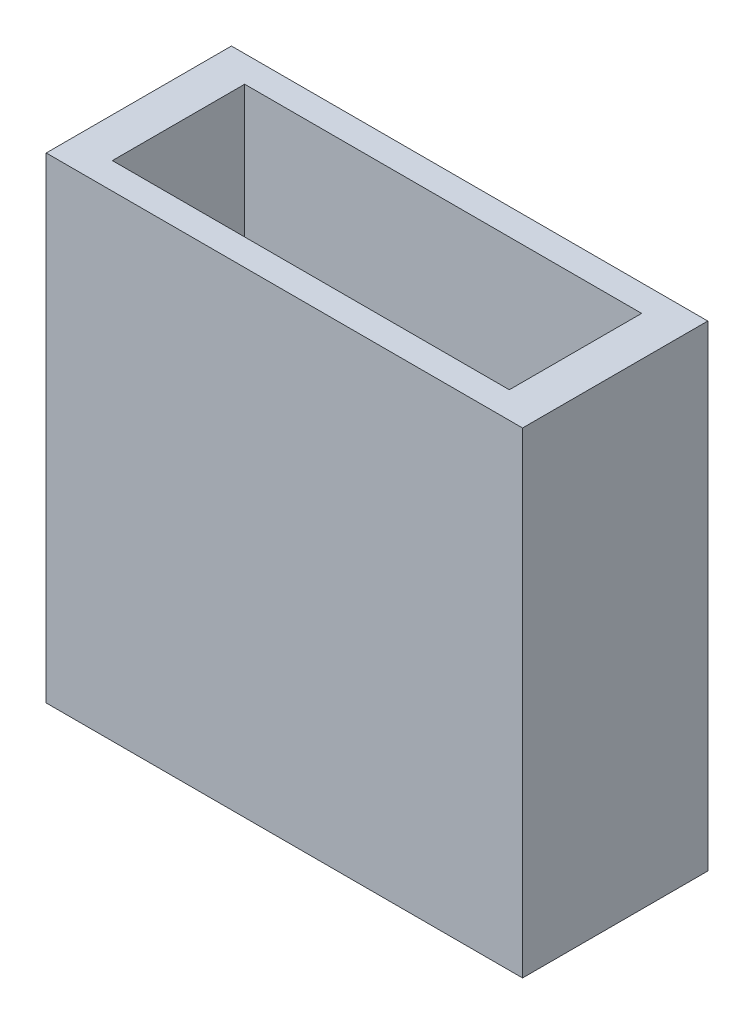
ISO-10303-21;
HEADER;
FILE_DESCRIPTION(('STEP AP214'),'2;1');
FILE_NAME('part.step','',(''),(''),'','','');
FILE_SCHEMA(('AUTOMOTIVE_DESIGN { 1 0 10303 214 1 1 1 1 }'));
ENDSEC;
DATA;
#1=APPLICATION_CONTEXT('core data for automotive mechanical design processes');
#2=APPLICATION_PROTOCOL_DEFINITION('international standard','automotive_design',2000,#1);
#3=PRODUCT_CONTEXT('',#1,'mechanical');
#4=PRODUCT('Part','Part','',(#3));
#5=PRODUCT_RELATED_PRODUCT_CATEGORY('part','',(#4));
#6=PRODUCT_DEFINITION_FORMATION('','',#4);
#7=PRODUCT_DEFINITION_CONTEXT('part definition',#1,'design');
#8=PRODUCT_DEFINITION('design','',#6,#7);
#9=PRODUCT_DEFINITION_SHAPE('','',#8);
#10=(LENGTH_UNIT() NAMED_UNIT(*) SI_UNIT(.MILLI.,.METRE.));
#11=(NAMED_UNIT(*) PLANE_ANGLE_UNIT() SI_UNIT($,.RADIAN.));
#12=(NAMED_UNIT(*) SI_UNIT($,.STERADIAN.) SOLID_ANGLE_UNIT());
#13=UNCERTAINTY_MEASURE_WITH_UNIT(LENGTH_MEASURE(1.E-05),#10,'distance_accuracy_value','');
#14=(GEOMETRIC_REPRESENTATION_CONTEXT(3) GLOBAL_UNCERTAINTY_ASSIGNED_CONTEXT((#13)) GLOBAL_UNIT_ASSIGNED_CONTEXT((#10,
#11,#12)) REPRESENTATION_CONTEXT('',''));
#15=CARTESIAN_POINT('',(0.,0.,0.));
#16=DIRECTION('',(0.,0.,1.));
#17=DIRECTION('',(1.,0.,0.));
#18=AXIS2_PLACEMENT_3D('',#15,#16,#17);
#19=CARTESIAN_POINT('',(0.,45.72,0.));
#20=DIRECTION('',(1.,0.,0.));
#21=DIRECTION('',(0.,0.,-1.));
#22=AXIS2_PLACEMENT_3D('',#19,#20,#21);
#23=PLANE('',#22);
#24=DIRECTION('',(0.,0.,1.));
#25=VECTOR('',#24,1.);
#26=CARTESIAN_POINT('',(0.,0.,0.));
#27=LINE('',#26,#25);
#28=CARTESIAN_POINT('',(0.,0.,-17.78));
#29=VERTEX_POINT('',#28);
#30=CARTESIAN_POINT('',(0.,0.,0.));
#31=VERTEX_POINT('',#30);
#32=EDGE_CURVE('E166',#29,#31,#27,.T.);
#33=ORIENTED_EDGE('',*,*,#32,.T.);
#34=DIRECTION('',(0.,-1.,0.));
#35=VECTOR('',#34,1.);
#36=CARTESIAN_POINT('',(0.,45.72,0.));
#37=LINE('',#36,#35);
#38=CARTESIAN_POINT('',(0.,45.72,0.));
#39=VERTEX_POINT('',#38);
#40=EDGE_CURVE('E11',#39,#31,#37,.T.);
#41=ORIENTED_EDGE('',*,*,#40,.F.);
#42=DIRECTION('',(0.,0.,1.));
#43=VECTOR('',#42,1.);
#44=CARTESIAN_POINT('',(0.,45.72,0.));
#45=LINE('',#44,#43);
#46=CARTESIAN_POINT('',(0.,45.72,-17.78));
#47=VERTEX_POINT('',#46);
#48=EDGE_CURVE('E172',#47,#39,#45,.T.);
#49=ORIENTED_EDGE('',*,*,#48,.F.);
#50=DIRECTION('',(0.,-1.,0.));
#51=VECTOR('',#50,1.);
#52=CARTESIAN_POINT('',(0.,45.72,-17.78));
#53=LINE('',#52,#51);
#54=EDGE_CURVE('E182',#47,#29,#53,.T.);
#55=ORIENTED_EDGE('',*,*,#54,.T.);
#56=EDGE_LOOP('',(#33,#41,#49,#55));
#57=FACE_BOUND('',#56,.T.);
#58=ADVANCED_FACE('F42',(#57),#23,.F.);
#59=CARTESIAN_POINT('',(0.,45.72,0.));
#60=DIRECTION('',(0.,0.,-1.));
#61=DIRECTION('',(-1.,0.,0.));
#62=AXIS2_PLACEMENT_3D('',#59,#60,#61);
#63=PLANE('',#62);
#64=DIRECTION('',(1.,0.,0.));
#65=VECTOR('',#64,1.);
#66=CARTESIAN_POINT('',(0.,0.,0.));
#67=LINE('',#66,#65);
#68=CARTESIAN_POINT('',(45.72,0.,0.));
#69=VERTEX_POINT('',#68);
#70=EDGE_CURVE('E186',#31,#69,#67,.T.);
#71=ORIENTED_EDGE('',*,*,#70,.T.);
#72=DIRECTION('',(0.,-1.,0.));
#73=VECTOR('',#72,1.);
#74=CARTESIAN_POINT('',(45.72,45.72,0.));
#75=LINE('',#74,#73);
#76=CARTESIAN_POINT('',(45.72,45.72,0.));
#77=VERTEX_POINT('',#76);
#78=EDGE_CURVE('E51',#77,#69,#75,.T.);
#79=ORIENTED_EDGE('',*,*,#78,.F.);
#80=DIRECTION('',(1.,0.,0.));
#81=VECTOR('',#80,1.);
#82=CARTESIAN_POINT('',(0.,45.72,0.));
#83=LINE('',#82,#81);
#84=EDGE_CURVE('E96',#39,#77,#83,.T.);
#85=ORIENTED_EDGE('',*,*,#84,.F.);
#86=ORIENTED_EDGE('',*,*,#40,.T.);
#87=EDGE_LOOP('',(#71,#79,#85,#86));
#88=FACE_BOUND('',#87,.T.);
#89=ADVANCED_FACE('F241',(#88),#63,.F.);
#90=CARTESIAN_POINT('',(45.72,45.72,0.));
#91=DIRECTION('',(-1.,0.,0.));
#92=DIRECTION('',(0.,0.,1.));
#93=AXIS2_PLACEMENT_3D('',#90,#91,#92);
#94=PLANE('',#93);
#95=DIRECTION('',(0.,0.,-1.));
#96=VECTOR('',#95,1.);
#97=CARTESIAN_POINT('',(45.72,0.,0.));
#98=LINE('',#97,#96);
#99=CARTESIAN_POINT('',(45.72,0.,-17.78));
#100=VERTEX_POINT('',#99);
#101=EDGE_CURVE('E189',#69,#100,#98,.T.);
#102=ORIENTED_EDGE('',*,*,#101,.T.);
#103=DIRECTION('',(0.,-1.,0.));
#104=VECTOR('',#103,1.);
#105=CARTESIAN_POINT('',(45.72,45.72,-17.78));
#106=LINE('',#105,#104);
#107=CARTESIAN_POINT('',(45.72,45.72,-17.78));
#108=VERTEX_POINT('',#107);
#109=EDGE_CURVE('E196',#108,#100,#106,.T.);
#110=ORIENTED_EDGE('',*,*,#109,.F.);
#111=DIRECTION('',(0.,0.,-1.));
#112=VECTOR('',#111,1.);
#113=CARTESIAN_POINT('',(45.72,45.72,0.));
#114=LINE('',#113,#112);
#115=EDGE_CURVE('E177',#77,#108,#114,.T.);
#116=ORIENTED_EDGE('',*,*,#115,.F.);
#117=ORIENTED_EDGE('',*,*,#78,.T.);
#118=EDGE_LOOP('',(#102,#110,#116,#117));
#119=FACE_BOUND('',#118,.T.);
#120=ADVANCED_FACE('F246',(#119),#94,.F.);
#121=CARTESIAN_POINT('',(0.,45.72,-17.78));
#122=DIRECTION('',(0.,0.,1.));
#123=DIRECTION('',(1.,0.,0.));
#124=AXIS2_PLACEMENT_3D('',#121,#122,#123);
#125=PLANE('',#124);
#126=DIRECTION('',(-1.,0.,0.));
#127=VECTOR('',#126,1.);
#128=CARTESIAN_POINT('',(0.,0.,-17.78));
#129=LINE('',#128,#127);
#130=EDGE_CURVE('E89',#100,#29,#129,.T.);
#131=ORIENTED_EDGE('',*,*,#130,.T.);
#132=ORIENTED_EDGE('',*,*,#54,.F.);
#133=DIRECTION('',(-1.,0.,0.));
#134=VECTOR('',#133,1.);
#135=CARTESIAN_POINT('',(0.,45.72,-17.78));
#136=LINE('',#135,#134);
#137=EDGE_CURVE('E68',#108,#47,#136,.T.);
#138=ORIENTED_EDGE('',*,*,#137,.F.);
#139=ORIENTED_EDGE('',*,*,#109,.T.);
#140=EDGE_LOOP('',(#131,#132,#138,#139));
#141=FACE_BOUND('',#140,.T.);
#142=ADVANCED_FACE('F256',(#141),#125,.F.);
#143=CARTESIAN_POINT('',(0.,45.72,0.));
#144=DIRECTION('',(0.,-1.,0.));
#145=DIRECTION('',(0.,0.,-1.));
#146=AXIS2_PLACEMENT_3D('',#143,#144,#145);
#147=PLANE('',#146);
#148=DIRECTION('',(1.,0.,0.));
#149=VECTOR('',#148,1.);
#150=CARTESIAN_POINT('',(3.81,45.72,-2.54));
#151=LINE('',#150,#149);
#152=CARTESIAN_POINT('',(3.81,45.72,-2.54));
#153=VERTEX_POINT('',#152);
#154=CARTESIAN_POINT('',(41.91,45.72,-2.54));
#155=VERTEX_POINT('',#154);
#156=EDGE_CURVE('E157',#153,#155,#151,.T.);
#157=ORIENTED_EDGE('',*,*,#156,.F.);
#158=DIRECTION('',(0.,0.,1.));
#159=VECTOR('',#158,1.);
#160=CARTESIAN_POINT('',(3.81,45.72,-2.54));
#161=LINE('',#160,#159);
#162=CARTESIAN_POINT('',(3.81,45.72,-15.24));
#163=VERTEX_POINT('',#162);
#164=EDGE_CURVE('E59',#163,#153,#161,.T.);
#165=ORIENTED_EDGE('',*,*,#164,.F.);
#166=DIRECTION('',(-1.,0.,0.));
#167=VECTOR('',#166,1.);
#168=CARTESIAN_POINT('',(3.81,45.72,-15.24));
#169=LINE('',#168,#167);
#170=CARTESIAN_POINT('',(41.91,45.72,-15.24));
#171=VERTEX_POINT('',#170);
#172=EDGE_CURVE('E141',#171,#163,#169,.T.);
#173=ORIENTED_EDGE('',*,*,#172,.F.);
#174=DIRECTION('',(0.,0.,-1.));
#175=VECTOR('',#174,1.);
#176=CARTESIAN_POINT('',(41.91,45.72,-2.54));
#177=LINE('',#176,#175);
#178=EDGE_CURVE('E145',#155,#171,#177,.T.);
#179=ORIENTED_EDGE('',*,*,#178,.F.);
#180=EDGE_LOOP('',(#157,#165,#173,#179));
#181=FACE_BOUND('',#180,.T.);
#182=ORIENTED_EDGE('',*,*,#48,.T.);
#183=ORIENTED_EDGE('',*,*,#84,.T.);
#184=ORIENTED_EDGE('',*,*,#115,.T.);
#185=ORIENTED_EDGE('',*,*,#137,.T.);
#186=EDGE_LOOP('',(#182,#183,#184,#185));
#187=FACE_BOUND('',#186,.T.);
#188=ADVANCED_FACE('F254',(#181,#187),#147,.F.);
#189=CARTESIAN_POINT('',(0.,0.,0.));
#190=DIRECTION('',(0.,-1.,0.));
#191=DIRECTION('',(0.,0.,-1.));
#192=AXIS2_PLACEMENT_3D('',#189,#190,#191);
#193=PLANE('',#192);
#194=CARTESIAN_POINT('',(29.7037039670805,0.,-8.88617054379551));
#195=DIRECTION('',(0.,-1.,0.));
#196=DIRECTION('',(-0.987688340595138,0.,-0.156434465040228));
#197=AXIS2_PLACEMENT_3D('',#194,#195,#196);
#198=ELLIPSE('',#197,3.10119923025932,3.048);
#199=CARTESIAN_POINT('',(26.6406856454908,0.,-9.37130498636429));
#200=VERTEX_POINT('',#199);
#201=EDGE_CURVE('E148',#200,#200,#198,.F.);
#202=ORIENTED_EDGE('',*,*,#201,.T.);
#203=EDGE_LOOP('',(#202));
#204=FACE_BOUND('',#203,.T.);
#205=CARTESIAN_POINT('',(15.2376722800284,0.,-8.88617054379551));
#206=DIRECTION('',(0.,-1.,0.));
#207=DIRECTION('',(-0.987688340595138,0.,-0.156434465040228));
#208=AXIS2_PLACEMENT_3D('',#205,#206,#207);
#209=ELLIPSE('',#208,3.10119923025932,3.048);
#210=CARTESIAN_POINT('',(12.1746539584387,0.,-9.37130498636429));
#211=VERTEX_POINT('',#210);
#212=EDGE_CURVE('E209',#211,#211,#209,.F.);
#213=ORIENTED_EDGE('',*,*,#212,.T.);
#214=EDGE_LOOP('',(#213));
#215=FACE_BOUND('',#214,.T.);
#216=CARTESIAN_POINT('',(22.4706881235545,0.,-8.88617054379551));
#217=DIRECTION('',(0.,-1.,0.));
#218=DIRECTION('',(-0.987688340595138,0.,-0.156434465040228));
#219=AXIS2_PLACEMENT_3D('',#216,#217,#218);
#220=ELLIPSE('',#219,3.10119923025931,3.04799999999999);
#221=CARTESIAN_POINT('',(19.4076698019647,0.,-9.37130498636429));
#222=VERTEX_POINT('',#221);
#223=EDGE_CURVE('E205',#222,#222,#220,.F.);
#224=ORIENTED_EDGE('',*,*,#223,.T.);
#225=EDGE_LOOP('',(#224));
#226=FACE_BOUND('',#225,.T.);
#227=ORIENTED_EDGE('',*,*,#32,.F.);
#228=ORIENTED_EDGE('',*,*,#130,.F.);
#229=ORIENTED_EDGE('',*,*,#101,.F.);
#230=ORIENTED_EDGE('',*,*,#70,.F.);
#231=EDGE_LOOP('',(#227,#228,#229,#230));
#232=FACE_BOUND('',#231,.T.);
#233=ADVANCED_FACE('F219',(#204,#215,#226,#232),#193,.T.);
#234=CARTESIAN_POINT('',(3.81,3.81,-2.54));
#235=DIRECTION('',(-1.,0.,0.));
#236=DIRECTION('',(0.,0.,1.));
#237=AXIS2_PLACEMENT_3D('',#234,#235,#236);
#238=PLANE('',#237);
#239=ORIENTED_EDGE('',*,*,#164,.T.);
#240=DIRECTION('',(0.,1.,0.));
#241=VECTOR('',#240,1.);
#242=CARTESIAN_POINT('',(3.81,3.81,-2.54));
#243=LINE('',#242,#241);
#244=CARTESIAN_POINT('',(3.81,3.81,-2.54));
#245=VERTEX_POINT('',#244);
#246=EDGE_CURVE('E116',#245,#153,#243,.T.);
#247=ORIENTED_EDGE('',*,*,#246,.F.);
#248=DIRECTION('',(0.,0.,1.));
#249=VECTOR('',#248,1.);
#250=CARTESIAN_POINT('',(3.81,3.81,-2.54));
#251=LINE('',#250,#249);
#252=CARTESIAN_POINT('',(3.81,3.81,-15.24));
#253=VERTEX_POINT('',#252);
#254=EDGE_CURVE('E120',#253,#245,#251,.T.);
#255=ORIENTED_EDGE('',*,*,#254,.F.);
#256=DIRECTION('',(0.,1.,0.));
#257=VECTOR('',#256,1.);
#258=CARTESIAN_POINT('',(3.81,3.81,-15.24));
#259=LINE('',#258,#257);
#260=EDGE_CURVE('E163',#253,#163,#259,.T.);
#261=ORIENTED_EDGE('',*,*,#260,.T.);
#262=EDGE_LOOP('',(#239,#247,#255,#261));
#263=FACE_BOUND('',#262,.T.);
#264=ADVANCED_FACE('F118',(#263),#238,.F.);
#265=CARTESIAN_POINT('',(3.81,3.81,-15.24));
#266=DIRECTION('',(0.,0.,-1.));
#267=DIRECTION('',(-1.,0.,0.));
#268=AXIS2_PLACEMENT_3D('',#265,#266,#267);
#269=PLANE('',#268);
#270=ORIENTED_EDGE('',*,*,#172,.T.);
#271=ORIENTED_EDGE('',*,*,#260,.F.);
#272=DIRECTION('',(-1.,0.,0.));
#273=VECTOR('',#272,1.);
#274=CARTESIAN_POINT('',(3.81,3.81,-15.24));
#275=LINE('',#274,#273);
#276=CARTESIAN_POINT('',(41.91,3.81,-15.24));
#277=VERTEX_POINT('',#276);
#278=EDGE_CURVE('E127',#277,#253,#275,.T.);
#279=ORIENTED_EDGE('',*,*,#278,.F.);
#280=DIRECTION('',(0.,1.,0.));
#281=VECTOR('',#280,1.);
#282=CARTESIAN_POINT('',(41.91,3.81,-15.24));
#283=LINE('',#282,#281);
#284=EDGE_CURVE('E167',#277,#171,#283,.T.);
#285=ORIENTED_EDGE('',*,*,#284,.T.);
#286=EDGE_LOOP('',(#270,#271,#279,#285));
#287=FACE_BOUND('',#286,.T.);
#288=ADVANCED_FACE('F293',(#287),#269,.F.);
#289=CARTESIAN_POINT('',(41.91,3.81,-2.54));
#290=DIRECTION('',(1.,0.,0.));
#291=DIRECTION('',(0.,0.,-1.));
#292=AXIS2_PLACEMENT_3D('',#289,#290,#291);
#293=PLANE('',#292);
#294=ORIENTED_EDGE('',*,*,#178,.T.);
#295=ORIENTED_EDGE('',*,*,#284,.F.);
#296=DIRECTION('',(0.,0.,-1.));
#297=VECTOR('',#296,1.);
#298=CARTESIAN_POINT('',(41.91,3.81,-2.54));
#299=LINE('',#298,#297);
#300=CARTESIAN_POINT('',(41.91,3.81,-2.54));
#301=VERTEX_POINT('',#300);
#302=EDGE_CURVE('E136',#301,#277,#299,.T.);
#303=ORIENTED_EDGE('',*,*,#302,.F.);
#304=DIRECTION('',(0.,1.,0.));
#305=VECTOR('',#304,1.);
#306=CARTESIAN_POINT('',(41.91,3.81,-2.54));
#307=LINE('',#306,#305);
#308=EDGE_CURVE('E126',#301,#155,#307,.T.);
#309=ORIENTED_EDGE('',*,*,#308,.T.);
#310=EDGE_LOOP('',(#294,#295,#303,#309));
#311=FACE_BOUND('',#310,.T.);
#312=ADVANCED_FACE('F235',(#311),#293,.F.);
#313=CARTESIAN_POINT('',(3.81,3.81,-2.54));
#314=DIRECTION('',(0.,0.,1.));
#315=DIRECTION('',(1.,0.,0.));
#316=AXIS2_PLACEMENT_3D('',#313,#314,#315);
#317=PLANE('',#316);
#318=ORIENTED_EDGE('',*,*,#156,.T.);
#319=ORIENTED_EDGE('',*,*,#308,.F.);
#320=DIRECTION('',(1.,0.,0.));
#321=VECTOR('',#320,1.);
#322=CARTESIAN_POINT('',(3.81,3.81,-2.54));
#323=LINE('',#322,#321);
#324=EDGE_CURVE('E130',#245,#301,#323,.T.);
#325=ORIENTED_EDGE('',*,*,#324,.F.);
#326=ORIENTED_EDGE('',*,*,#246,.T.);
#327=EDGE_LOOP('',(#318,#319,#325,#326));
#328=FACE_BOUND('',#327,.T.);
#329=ADVANCED_FACE('F131',(#328),#317,.F.);
#330=CARTESIAN_POINT('',(0.,3.81,0.));
#331=DIRECTION('',(0.,-1.,0.));
#332=DIRECTION('',(0.,0.,-1.));
#333=AXIS2_PLACEMENT_3D('',#330,#331,#332);
#334=PLANE('',#333);
#335=CARTESIAN_POINT('',(28.9975622058914,3.81,-8.99801241143123));
#336=DIRECTION('',(0.,-1.,0.));
#337=DIRECTION('',(-0.987688340595138,0.,-0.156434465040228));
#338=AXIS2_PLACEMENT_3D('',#335,#336,#337);
#339=ELLIPSE('',#338,3.10119923025932,3.048);
#340=CARTESIAN_POINT('',(25.9345438843016,3.81,-9.48314685400002));
#341=VERTEX_POINT('',#340);
#342=EDGE_CURVE('E45',#341,#341,#339,.F.);
#343=ORIENTED_EDGE('',*,*,#342,.F.);
#344=EDGE_LOOP('',(#343));
#345=FACE_BOUND('',#344,.T.);
#346=CARTESIAN_POINT('',(14.5315305188393,3.81,-8.99801241143123));
#347=DIRECTION('',(0.,-1.,0.));
#348=DIRECTION('',(-0.987688340595138,0.,-0.156434465040228));
#349=AXIS2_PLACEMENT_3D('',#346,#347,#348);
#350=ELLIPSE('',#349,3.10119923025932,3.048);
#351=CARTESIAN_POINT('',(11.4685121972495,3.81,-9.48314685400001));
#352=VERTEX_POINT('',#351);
#353=EDGE_CURVE('E206',#352,#352,#350,.F.);
#354=ORIENTED_EDGE('',*,*,#353,.F.);
#355=EDGE_LOOP('',(#354));
#356=FACE_BOUND('',#355,.T.);
#357=CARTESIAN_POINT('',(21.7645463623653,3.81,-8.99801241143123));
#358=DIRECTION('',(0.,-1.,0.));
#359=DIRECTION('',(-0.987688340595138,0.,-0.156434465040228));
#360=AXIS2_PLACEMENT_3D('',#357,#358,#359);
#361=ELLIPSE('',#360,3.10119923025931,3.04799999999999);
#362=CARTESIAN_POINT('',(18.7015280407756,3.81,-9.48314685400001));
#363=VERTEX_POINT('',#362);
#364=EDGE_CURVE('E202',#363,#363,#361,.F.);
#365=ORIENTED_EDGE('',*,*,#364,.F.);
#366=EDGE_LOOP('',(#365));
#367=FACE_BOUND('',#366,.T.);
#368=ORIENTED_EDGE('',*,*,#254,.T.);
#369=ORIENTED_EDGE('',*,*,#324,.T.);
#370=ORIENTED_EDGE('',*,*,#302,.T.);
#371=ORIENTED_EDGE('',*,*,#278,.T.);
#372=EDGE_LOOP('',(#368,#369,#370,#371));
#373=FACE_BOUND('',#372,.T.);
#374=ADVANCED_FACE('F138',(#345,#356,#367,#373),#334,.F.);
#375=CARTESIAN_POINT('',(23.2888516987593,-4.41441562142005,-8.75658616384277));
#376=DIRECTION('',(-0.182159663732433,0.982845594136539,-0.0288512563899666));
#377=DIRECTION('',(-0.983254907563954,-0.182235525492148,0.));
#378=AXIS2_PLACEMENT_3D('',#375,#376,#377);
#379=CYLINDRICAL_SURFACE('',#378,3.04799999999999);
#380=ORIENTED_EDGE('',*,*,#223,.F.);
#381=EDGE_LOOP('',(#380));
#382=FACE_BOUND('',#381,.T.);
#383=ORIENTED_EDGE('',*,*,#364,.T.);
#384=EDGE_LOOP('',(#383));
#385=FACE_BOUND('',#384,.T.);
#386=ADVANCED_FACE('F222',(#382,#385),#379,.F.);
#387=CARTESIAN_POINT('',(16.2958428219334,-5.70937733220705,-8.71857279474797));
#388=DIRECTION('',(-0.182159663732433,0.982845594136539,-0.0288512563899666));
#389=DIRECTION('',(-0.983254907563954,-0.182235525492148,0.));
#390=AXIS2_PLACEMENT_3D('',#387,#388,#389);
#391=CYLINDRICAL_SURFACE('',#390,3.048);
#392=ORIENTED_EDGE('',*,*,#212,.F.);
#393=EDGE_LOOP('',(#392));
#394=FACE_BOUND('',#393,.T.);
#395=ORIENTED_EDGE('',*,*,#353,.T.);
#396=EDGE_LOOP('',(#395));
#397=FACE_BOUND('',#396,.T.);
#398=ADVANCED_FACE('F225',(#394,#397),#391,.F.);
#399=CARTESIAN_POINT('',(30.2818605755852,-3.11945391063304,-8.79459953293757));
#400=DIRECTION('',(-0.182159663732433,0.982845594136539,-0.0288512563899666));
#401=DIRECTION('',(-0.983254907563954,-0.182235525492148,0.));
#402=AXIS2_PLACEMENT_3D('',#399,#400,#401);
#403=CYLINDRICAL_SURFACE('',#402,3.048);
#404=ORIENTED_EDGE('',*,*,#201,.F.);
#405=EDGE_LOOP('',(#404));
#406=FACE_BOUND('',#405,.T.);
#407=ORIENTED_EDGE('',*,*,#342,.T.);
#408=EDGE_LOOP('',(#407));
#409=FACE_BOUND('',#408,.T.);
#410=ADVANCED_FACE('F346',(#406,#409),#403,.F.);
#411=CLOSED_SHELL('',(#58,#89,#120,#142,#188,#233,#264,#288,#312,#329,#374,#386,#398,#410));
#412=MANIFOLD_SOLID_BREP('B2',#411);
#413=ADVANCED_BREP_SHAPE_REPRESENTATION('',(#18,#412),#14);
#414=SHAPE_DEFINITION_REPRESENTATION(#9,#413);
ENDSEC;
END-ISO-10303-21;
